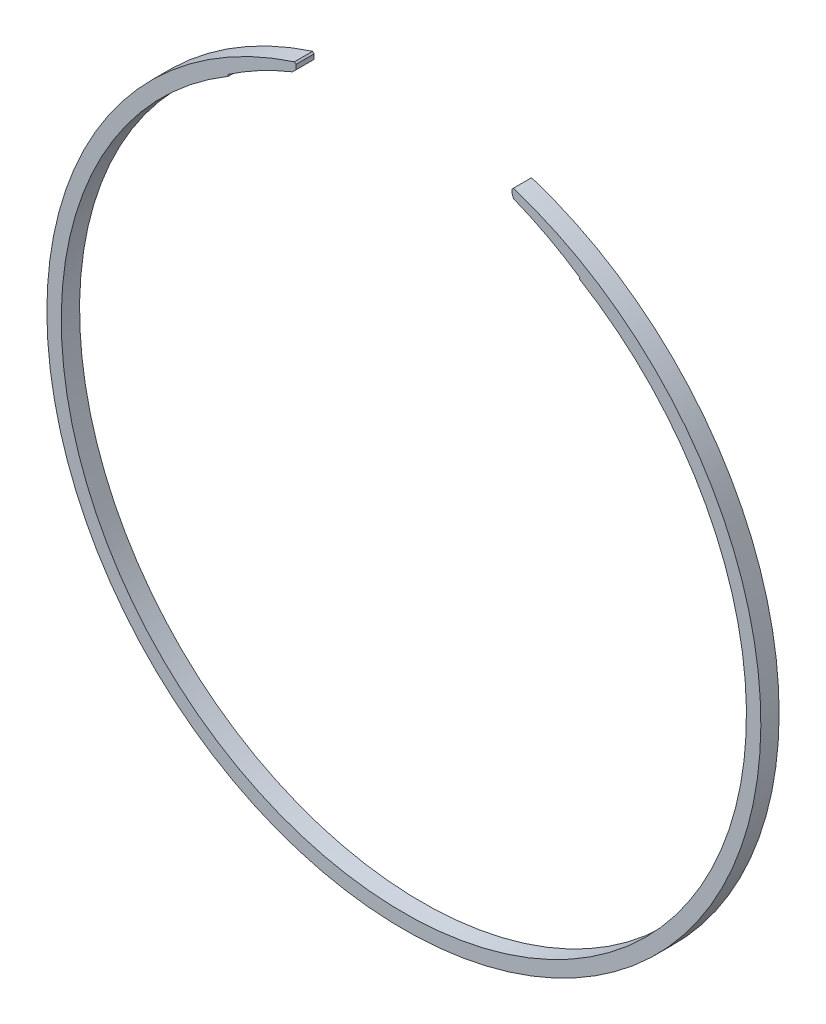
ISO-10303-21;
HEADER;
FILE_DESCRIPTION(('STEP AP214'),'2;1');
FILE_NAME('part.step','',(''),(''),'','','');
FILE_SCHEMA(('AUTOMOTIVE_DESIGN { 1 0 10303 214 1 1 1 1 }'));
ENDSEC;
DATA;
#1=APPLICATION_CONTEXT('core data for automotive mechanical design processes');
#2=APPLICATION_PROTOCOL_DEFINITION('international standard','automotive_design',2000,#1);
#3=PRODUCT_CONTEXT('',#1,'mechanical');
#4=PRODUCT('Part','Part','',(#3));
#5=PRODUCT_RELATED_PRODUCT_CATEGORY('part','',(#4));
#6=PRODUCT_DEFINITION_FORMATION('','',#4);
#7=PRODUCT_DEFINITION_CONTEXT('part definition',#1,'design');
#8=PRODUCT_DEFINITION('design','',#6,#7);
#9=PRODUCT_DEFINITION_SHAPE('','',#8);
#10=(LENGTH_UNIT() NAMED_UNIT(*) SI_UNIT(.MILLI.,.METRE.));
#11=(NAMED_UNIT(*) PLANE_ANGLE_UNIT() SI_UNIT($,.RADIAN.));
#12=(NAMED_UNIT(*) SI_UNIT($,.STERADIAN.) SOLID_ANGLE_UNIT());
#13=UNCERTAINTY_MEASURE_WITH_UNIT(LENGTH_MEASURE(1.E-05),#10,'distance_accuracy_value','');
#14=(GEOMETRIC_REPRESENTATION_CONTEXT(3) GLOBAL_UNCERTAINTY_ASSIGNED_CONTEXT((#13)) GLOBAL_UNIT_ASSIGNED_CONTEXT((#10,
#11,#12)) REPRESENTATION_CONTEXT('',''));
#15=CARTESIAN_POINT('',(0.,0.,0.));
#16=DIRECTION('',(0.,0.,1.));
#17=DIRECTION('',(1.,0.,0.));
#18=AXIS2_PLACEMENT_3D('',#15,#16,#17);
#19=CARTESIAN_POINT('',(0.,0.,6.35));
#20=DIRECTION('',(0.,0.,1.));
#21=DIRECTION('',(1.,0.,0.));
#22=AXIS2_PLACEMENT_3D('',#19,#20,#21);
#23=PLANE('',#22);
#24=DIRECTION('',(0.,1.,0.));
#25=VECTOR('',#24,1.);
#26=CARTESIAN_POINT('',(37.5,115.13848877654,6.35));
#27=LINE('',#26,#25);
#28=CARTESIAN_POINT('',(37.5,116.377362522914,6.35));
#29=VERTEX_POINT('',#28);
#30=CARTESIAN_POINT('',(37.5,117.493696955464,6.35));
#31=VERTEX_POINT('',#30);
#32=EDGE_CURVE('E215',#29,#31,#27,.T.);
#33=ORIENTED_EDGE('',*,*,#32,.F.);
#34=DIRECTION('',(-0.399536069175166,0.91671747524963,0.));
#35=VECTOR('',#34,1.);
#36=CARTESIAN_POINT('',(74.1384800976588,32.3120238378502,6.35));
#37=LINE('',#36,#35);
#38=CARTESIAN_POINT('',(38.1526630091302,114.879856710351,6.35));
#39=VERTEX_POINT('',#38);
#40=EDGE_CURVE('E191',#29,#39,#37,.F.);
#41=ORIENTED_EDGE('',*,*,#40,.T.);
#42=CARTESIAN_POINT('',(-6.74999999999999,2.51994012668422,6.35));
#43=DIRECTION('',(0.,0.,-1.));
#44=DIRECTION('',(1.,0.,0.));
#45=AXIS2_PLACEMENT_3D('',#42,#43,#44);
#46=CIRCLE('',#45,121.);
#47=CARTESIAN_POINT('',(61.195564516129,102.641867108662,6.35));
#48=VERTEX_POINT('',#47);
#49=EDGE_CURVE('E146',#39,#48,#46,.T.);
#50=ORIENTED_EDGE('',*,*,#49,.T.);
#51=DIRECTION('',(0.512096774193548,0.858927758231484,0.));
#52=VECTOR('',#51,1.);
#53=CARTESIAN_POINT('',(0.,0.,6.35));
#54=LINE('',#53,#52);
#55=CARTESIAN_POINT('',(60.9395161290323,102.212403229547,6.35));
#56=VERTEX_POINT('',#55);
#57=EDGE_CURVE('E133',#56,#48,#54,.T.);
#58=ORIENTED_EDGE('',*,*,#57,.F.);
#59=CARTESIAN_POINT('',(0.,0.,6.35));
#60=DIRECTION('',(0.,0.,1.));
#61=DIRECTION('',(1.,0.,0.));
#62=AXIS2_PLACEMENT_3D('',#59,#60,#61);
#63=CIRCLE('',#62,119.);
#64=CARTESIAN_POINT('',(-60.9395161290323,102.212403229547,6.35));
#65=VERTEX_POINT('',#64);
#66=EDGE_CURVE('E129',#65,#56,#63,.T.);
#67=ORIENTED_EDGE('',*,*,#66,.F.);
#68=DIRECTION('',(0.512096774193548,-0.858927758231484,0.));
#69=VECTOR('',#68,1.);
#70=CARTESIAN_POINT('',(-63.5,106.507042020704,6.35));
#71=LINE('',#70,#69);
#72=CARTESIAN_POINT('',(-61.195564516129,102.641867108662,6.35));
#73=VERTEX_POINT('',#72);
#74=EDGE_CURVE('E122',#73,#65,#71,.T.);
#75=ORIENTED_EDGE('',*,*,#74,.F.);
#76=CARTESIAN_POINT('',(6.75000000000001,2.51994012668422,6.35));
#77=DIRECTION('',(0.,0.,-1.));
#78=DIRECTION('',(-1.,0.,0.));
#79=AXIS2_PLACEMENT_3D('',#76,#77,#78);
#80=CIRCLE('',#79,121.);
#81=CARTESIAN_POINT('',(-38.664555730153,114.673933046387,6.35));
#82=VERTEX_POINT('',#81);
#83=EDGE_CURVE('E126',#73,#82,#80,.T.);
#84=ORIENTED_EDGE('',*,*,#83,.T.);
#85=DIRECTION('',(-0.707106781186552,-0.707106781186543,0.));
#86=VECTOR('',#85,1.);
#87=CARTESIAN_POINT('',(-76.66924438827,76.6692443882709,6.35));
#88=LINE('',#87,#86);
#89=CARTESIAN_POINT('',(-37.5,115.83848877654,6.35));
#90=VERTEX_POINT('',#89);
#91=EDGE_CURVE('E187',#82,#90,#88,.F.);
#92=ORIENTED_EDGE('',*,*,#91,.T.);
#93=DIRECTION('',(0.,-1.,0.));
#94=VECTOR('',#93,1.);
#95=CARTESIAN_POINT('',(-37.5,115.13848877654,6.35));
#96=LINE('',#95,#94);
#97=CARTESIAN_POINT('',(-37.5,117.493696955464,6.35));
#98=VERTEX_POINT('',#97);
#99=EDGE_CURVE('E211',#98,#90,#96,.T.);
#100=ORIENTED_EDGE('',*,*,#99,.F.);
#101=DIRECTION('',(0.707106781186548,-0.707106781186548,0.));
#102=VECTOR('',#101,1.);
#103=CARTESIAN_POINT('',(39.9968484777318,39.9968484777318,6.35));
#104=LINE('',#103,#102);
#105=CARTESIAN_POINT('',(-38.0304038886649,118.024100844129,6.35));
#106=VERTEX_POINT('',#105);
#107=EDGE_CURVE('E185',#98,#106,#104,.F.);
#108=ORIENTED_EDGE('',*,*,#107,.T.);
#109=CARTESIAN_POINT('',(0.,0.,6.35));
#110=DIRECTION('',(0.,0.,1.));
#111=DIRECTION('',(1.,0.,0.));
#112=AXIS2_PLACEMENT_3D('',#109,#110,#111);
#113=CIRCLE('',#112,124.);
#114=CARTESIAN_POINT('',(38.0304038886649,118.024100844129,6.35));
#115=VERTEX_POINT('',#114);
#116=EDGE_CURVE('E171',#106,#115,#113,.T.);
#117=ORIENTED_EDGE('',*,*,#116,.T.);
#118=DIRECTION('',(-0.707106781186557,-0.707106781186538,0.));
#119=VECTOR('',#118,1.);
#120=CARTESIAN_POINT('',(-39.9968484777323,39.9968484777334,6.35));
#121=LINE('',#120,#119);
#122=EDGE_CURVE('E189',#115,#31,#121,.T.);
#123=ORIENTED_EDGE('',*,*,#122,.T.);
#124=EDGE_LOOP('',(#33,#41,#50,#58,#67,#75,#84,#92,#100,#108,#117,#123));
#125=FACE_BOUND('',#124,.T.);
#126=ADVANCED_FACE('F32',(#125),#23,.T.);
#127=CARTESIAN_POINT('',(0.,0.,0.));
#128=DIRECTION('',(0.,0.,1.));
#129=DIRECTION('',(1.,0.,0.));
#130=AXIS2_PLACEMENT_3D('',#127,#128,#129);
#131=PLANE('',#130);
#132=CARTESIAN_POINT('',(-6.74999999999999,2.51994012668422,0.));
#133=DIRECTION('',(0.,0.,-1.));
#134=DIRECTION('',(1.,0.,0.));
#135=AXIS2_PLACEMENT_3D('',#132,#133,#134);
#136=CIRCLE('',#135,121.);
#137=CARTESIAN_POINT('',(38.1526630091302,114.879856710351,0.));
#138=VERTEX_POINT('',#137);
#139=CARTESIAN_POINT('',(61.195564516129,102.641867108662,0.));
#140=VERTEX_POINT('',#139);
#141=EDGE_CURVE('E155',#138,#140,#136,.T.);
#142=ORIENTED_EDGE('',*,*,#141,.F.);
#143=DIRECTION('',(0.399536069175166,-0.91671747524963,0.));
#144=VECTOR('',#143,1.);
#145=CARTESIAN_POINT('',(37.5,116.377362522914,0.));
#146=LINE('',#145,#144);
#147=CARTESIAN_POINT('',(37.5,116.377362522914,0.));
#148=VERTEX_POINT('',#147);
#149=EDGE_CURVE('E200',#138,#148,#146,.F.);
#150=ORIENTED_EDGE('',*,*,#149,.T.);
#151=DIRECTION('',(0.,1.,0.));
#152=VECTOR('',#151,1.);
#153=CARTESIAN_POINT('',(37.5,115.13848877654,0.));
#154=LINE('',#153,#152);
#155=CARTESIAN_POINT('',(37.5,117.493696955464,0.));
#156=VERTEX_POINT('',#155);
#157=EDGE_CURVE('E147',#148,#156,#154,.T.);
#158=ORIENTED_EDGE('',*,*,#157,.T.);
#159=DIRECTION('',(0.707106781186557,0.707106781186538,0.));
#160=VECTOR('',#159,1.);
#161=CARTESIAN_POINT('',(38.0304038886649,118.024100844129,0.));
#162=LINE('',#161,#160);
#163=CARTESIAN_POINT('',(38.0304038886649,118.024100844129,0.));
#164=VERTEX_POINT('',#163);
#165=EDGE_CURVE('E198',#156,#164,#162,.T.);
#166=ORIENTED_EDGE('',*,*,#165,.T.);
#167=CARTESIAN_POINT('',(0.,0.,0.));
#168=DIRECTION('',(0.,0.,1.));
#169=DIRECTION('',(1.,0.,0.));
#170=AXIS2_PLACEMENT_3D('',#167,#168,#169);
#171=CIRCLE('',#170,124.);
#172=CARTESIAN_POINT('',(-38.0304038886649,118.024100844129,0.));
#173=VERTEX_POINT('',#172);
#174=EDGE_CURVE('E168',#173,#164,#171,.T.);
#175=ORIENTED_EDGE('',*,*,#174,.F.);
#176=DIRECTION('',(-0.707106781186548,0.707106781186548,0.));
#177=VECTOR('',#176,1.);
#178=CARTESIAN_POINT('',(-38.0304038886649,118.024100844129,0.));
#179=LINE('',#178,#177);
#180=CARTESIAN_POINT('',(-37.5,117.493696955464,0.));
#181=VERTEX_POINT('',#180);
#182=EDGE_CURVE('E195',#173,#181,#179,.F.);
#183=ORIENTED_EDGE('',*,*,#182,.T.);
#184=DIRECTION('',(0.,-1.,0.));
#185=VECTOR('',#184,1.);
#186=CARTESIAN_POINT('',(-37.5,115.13848877654,0.));
#187=LINE('',#186,#185);
#188=CARTESIAN_POINT('',(-37.5,115.83848877654,0.));
#189=VERTEX_POINT('',#188);
#190=EDGE_CURVE('E152',#181,#189,#187,.T.);
#191=ORIENTED_EDGE('',*,*,#190,.T.);
#192=DIRECTION('',(0.707106781186552,0.707106781186543,0.));
#193=VECTOR('',#192,1.);
#194=CARTESIAN_POINT('',(-38.664555730153,114.673933046387,0.));
#195=LINE('',#194,#193);
#196=CARTESIAN_POINT('',(-38.664555730153,114.673933046387,0.));
#197=VERTEX_POINT('',#196);
#198=EDGE_CURVE('E47',#189,#197,#195,.F.);
#199=ORIENTED_EDGE('',*,*,#198,.T.);
#200=CARTESIAN_POINT('',(6.75000000000001,2.51994012668422,0.));
#201=DIRECTION('',(0.,0.,-1.));
#202=DIRECTION('',(-1.,0.,0.));
#203=AXIS2_PLACEMENT_3D('',#200,#201,#202);
#204=CIRCLE('',#203,121.);
#205=CARTESIAN_POINT('',(-61.195564516129,102.641867108662,0.));
#206=VERTEX_POINT('',#205);
#207=EDGE_CURVE('E149',#206,#197,#204,.T.);
#208=ORIENTED_EDGE('',*,*,#207,.F.);
#209=DIRECTION('',(0.512096774193548,-0.858927758231484,0.));
#210=VECTOR('',#209,1.);
#211=CARTESIAN_POINT('',(-63.5,106.507042020704,0.));
#212=LINE('',#211,#210);
#213=CARTESIAN_POINT('',(-60.9395161290323,102.212403229547,0.));
#214=VERTEX_POINT('',#213);
#215=EDGE_CURVE('E138',#206,#214,#212,.T.);
#216=ORIENTED_EDGE('',*,*,#215,.T.);
#217=CARTESIAN_POINT('',(0.,0.,0.));
#218=DIRECTION('',(0.,0.,1.));
#219=DIRECTION('',(1.,0.,0.));
#220=AXIS2_PLACEMENT_3D('',#217,#218,#219);
#221=CIRCLE('',#220,119.);
#222=CARTESIAN_POINT('',(60.9395161290323,102.212403229547,0.));
#223=VERTEX_POINT('',#222);
#224=EDGE_CURVE('E163',#214,#223,#221,.T.);
#225=ORIENTED_EDGE('',*,*,#224,.T.);
#226=DIRECTION('',(0.512096774193548,0.858927758231484,0.));
#227=VECTOR('',#226,1.);
#228=CARTESIAN_POINT('',(0.,0.,0.));
#229=LINE('',#228,#227);
#230=EDGE_CURVE('E161',#223,#140,#229,.T.);
#231=ORIENTED_EDGE('',*,*,#230,.T.);
#232=EDGE_LOOP('',(#142,#150,#158,#166,#175,#183,#191,#199,#208,#216,#225,#231));
#233=FACE_BOUND('',#232,.T.);
#234=ADVANCED_FACE('F223',(#233),#131,.F.);
#235=CARTESIAN_POINT('',(0.,0.,6.35));
#236=DIRECTION('',(0.,0.,-1.));
#237=DIRECTION('',(-1.,0.,0.));
#238=AXIS2_PLACEMENT_3D('',#235,#236,#237);
#239=CYLINDRICAL_SURFACE('',#238,124.);
#240=ORIENTED_EDGE('',*,*,#174,.T.);
#241=DIRECTION('',(0.,0.,-1.));
#242=VECTOR('',#241,1.);
#243=CARTESIAN_POINT('',(38.0304038886649,118.024100844129,6.35));
#244=LINE('',#243,#242);
#245=EDGE_CURVE('E205',#164,#115,#244,.F.);
#246=ORIENTED_EDGE('',*,*,#245,.T.);
#247=ORIENTED_EDGE('',*,*,#116,.F.);
#248=DIRECTION('',(0.,0.,-1.));
#249=VECTOR('',#248,1.);
#250=CARTESIAN_POINT('',(-38.0304038886649,118.024100844129,6.35));
#251=LINE('',#250,#249);
#252=EDGE_CURVE('E202',#106,#173,#251,.T.);
#253=ORIENTED_EDGE('',*,*,#252,.T.);
#254=EDGE_LOOP('',(#240,#246,#247,#253));
#255=FACE_BOUND('',#254,.T.);
#256=ADVANCED_FACE('F220',(#255),#239,.T.);
#257=CARTESIAN_POINT('',(0.,0.,6.35));
#258=DIRECTION('',(0.,0.,-1.));
#259=DIRECTION('',(-1.,0.,0.));
#260=AXIS2_PLACEMENT_3D('',#257,#258,#259);
#261=CYLINDRICAL_SURFACE('',#260,119.);
#262=DIRECTION('',(0.,0.,-1.));
#263=VECTOR('',#262,1.);
#264=CARTESIAN_POINT('',(60.9395161290323,102.212403229547,6.35));
#265=LINE('',#264,#263);
#266=EDGE_CURVE('E178',#223,#56,#265,.F.);
#267=ORIENTED_EDGE('',*,*,#266,.F.);
#268=ORIENTED_EDGE('',*,*,#224,.F.);
#269=DIRECTION('',(0.,0.,-1.));
#270=VECTOR('',#269,1.);
#271=CARTESIAN_POINT('',(-60.9395161290323,102.212403229547,6.35));
#272=LINE('',#271,#270);
#273=EDGE_CURVE('E174',#65,#214,#272,.T.);
#274=ORIENTED_EDGE('',*,*,#273,.F.);
#275=ORIENTED_EDGE('',*,*,#66,.T.);
#276=EDGE_LOOP('',(#267,#268,#274,#275));
#277=FACE_BOUND('',#276,.T.);
#278=ADVANCED_FACE('F246',(#277),#261,.F.);
#279=CARTESIAN_POINT('',(-63.5,106.507042020704,0.));
#280=DIRECTION('',(-0.858927758231484,-0.512096774193548,0.));
#281=DIRECTION('',(0.512096774193548,-0.858927758231484,0.));
#282=AXIS2_PLACEMENT_3D('',#279,#280,#281);
#283=PLANE('',#282);
#284=ORIENTED_EDGE('',*,*,#215,.F.);
#285=DIRECTION('',(0.,0.,1.));
#286=VECTOR('',#285,1.);
#287=CARTESIAN_POINT('',(-61.195564516129,102.641867108662,0.));
#288=LINE('',#287,#286);
#289=EDGE_CURVE('E134',#206,#73,#288,.T.);
#290=ORIENTED_EDGE('',*,*,#289,.T.);
#291=ORIENTED_EDGE('',*,*,#74,.T.);
#292=ORIENTED_EDGE('',*,*,#273,.T.);
#293=EDGE_LOOP('',(#284,#290,#291,#292));
#294=FACE_BOUND('',#293,.T.);
#295=ADVANCED_FACE('F137',(#294),#283,.F.);
#296=CARTESIAN_POINT('',(0.,0.,0.));
#297=DIRECTION('',(0.858927758231484,-0.512096774193548,0.));
#298=DIRECTION('',(0.512096774193548,0.858927758231484,0.));
#299=AXIS2_PLACEMENT_3D('',#296,#297,#298);
#300=PLANE('',#299);
#301=ORIENTED_EDGE('',*,*,#57,.T.);
#302=DIRECTION('',(0.,0.,1.));
#303=VECTOR('',#302,1.);
#304=CARTESIAN_POINT('',(61.195564516129,102.641867108662,0.));
#305=LINE('',#304,#303);
#306=EDGE_CURVE('E140',#140,#48,#305,.T.);
#307=ORIENTED_EDGE('',*,*,#306,.F.);
#308=ORIENTED_EDGE('',*,*,#230,.F.);
#309=ORIENTED_EDGE('',*,*,#266,.T.);
#310=EDGE_LOOP('',(#301,#307,#308,#309));
#311=FACE_BOUND('',#310,.T.);
#312=ADVANCED_FACE('F242',(#311),#300,.F.);
#313=CARTESIAN_POINT('',(6.75000000000001,2.51994012668422,0.));
#314=DIRECTION('',(0.,0.,1.));
#315=DIRECTION('',(1.,0.,0.));
#316=AXIS2_PLACEMENT_3D('',#313,#314,#315);
#317=CYLINDRICAL_SURFACE('',#316,121.);
#318=ORIENTED_EDGE('',*,*,#207,.T.);
#319=DIRECTION('',(0.,0.,1.));
#320=VECTOR('',#319,1.);
#321=CARTESIAN_POINT('',(-38.664555730153,114.673933046387,0.));
#322=LINE('',#321,#320);
#323=EDGE_CURVE('E145',#197,#82,#322,.T.);
#324=ORIENTED_EDGE('',*,*,#323,.T.);
#325=ORIENTED_EDGE('',*,*,#83,.F.);
#326=ORIENTED_EDGE('',*,*,#289,.F.);
#327=EDGE_LOOP('',(#318,#324,#325,#326));
#328=FACE_BOUND('',#327,.T.);
#329=ADVANCED_FACE('F143',(#328),#317,.F.);
#330=CARTESIAN_POINT('',(-6.74999999999999,2.51994012668422,0.));
#331=DIRECTION('',(0.,0.,1.));
#332=DIRECTION('',(1.,0.,0.));
#333=AXIS2_PLACEMENT_3D('',#330,#331,#332);
#334=CYLINDRICAL_SURFACE('',#333,121.);
#335=ORIENTED_EDGE('',*,*,#49,.F.);
#336=DIRECTION('',(0.,0.,1.));
#337=VECTOR('',#336,1.);
#338=CARTESIAN_POINT('',(38.1526630091302,114.879856710351,0.));
#339=LINE('',#338,#337);
#340=EDGE_CURVE('E193',#39,#138,#339,.F.);
#341=ORIENTED_EDGE('',*,*,#340,.T.);
#342=ORIENTED_EDGE('',*,*,#141,.T.);
#343=ORIENTED_EDGE('',*,*,#306,.T.);
#344=EDGE_LOOP('',(#335,#341,#342,#343));
#345=FACE_BOUND('',#344,.T.);
#346=ADVANCED_FACE('F238',(#345),#334,.F.);
#347=CARTESIAN_POINT('',(37.5,115.13848877654,0.));
#348=DIRECTION('',(1.,0.,0.));
#349=DIRECTION('',(0.,0.,-1.));
#350=AXIS2_PLACEMENT_3D('',#347,#348,#349);
#351=PLANE('',#350);
#352=ORIENTED_EDGE('',*,*,#157,.F.);
#353=DIRECTION('',(0.,0.,1.));
#354=VECTOR('',#353,1.);
#355=CARTESIAN_POINT('',(37.5,116.377362522914,6.35));
#356=LINE('',#355,#354);
#357=EDGE_CURVE('E182',#148,#29,#356,.T.);
#358=ORIENTED_EDGE('',*,*,#357,.T.);
#359=ORIENTED_EDGE('',*,*,#32,.T.);
#360=DIRECTION('',(0.,0.,-1.));
#361=VECTOR('',#360,1.);
#362=CARTESIAN_POINT('',(37.5,117.493696955464,0.));
#363=LINE('',#362,#361);
#364=EDGE_CURVE('E180',#31,#156,#363,.T.);
#365=ORIENTED_EDGE('',*,*,#364,.T.);
#366=EDGE_LOOP('',(#352,#358,#359,#365));
#367=FACE_BOUND('',#366,.T.);
#368=ADVANCED_FACE('F231',(#367),#351,.F.);
#369=CARTESIAN_POINT('',(-37.5,115.13848877654,0.));
#370=DIRECTION('',(-1.,0.,0.));
#371=DIRECTION('',(0.,0.,1.));
#372=AXIS2_PLACEMENT_3D('',#369,#370,#371);
#373=PLANE('',#372);
#374=ORIENTED_EDGE('',*,*,#99,.T.);
#375=DIRECTION('',(0.,0.,-1.));
#376=VECTOR('',#375,1.);
#377=CARTESIAN_POINT('',(-37.5,115.83848877654,0.));
#378=LINE('',#377,#376);
#379=EDGE_CURVE('E11',#90,#189,#378,.T.);
#380=ORIENTED_EDGE('',*,*,#379,.T.);
#381=ORIENTED_EDGE('',*,*,#190,.F.);
#382=DIRECTION('',(0.,0.,1.));
#383=VECTOR('',#382,1.);
#384=CARTESIAN_POINT('',(-37.5,117.493696955464,0.));
#385=LINE('',#384,#383);
#386=EDGE_CURVE('E40',#181,#98,#385,.T.);
#387=ORIENTED_EDGE('',*,*,#386,.T.);
#388=EDGE_LOOP('',(#374,#380,#381,#387));
#389=FACE_BOUND('',#388,.T.);
#390=ADVANCED_FACE('F210',(#389),#373,.F.);
#391=CARTESIAN_POINT('',(37.5,116.377362522914,0.));
#392=DIRECTION('',(0.91671747524963,0.399536069175166,0.));
#393=DIRECTION('',(0.,0.,1.));
#394=AXIS2_PLACEMENT_3D('',#391,#392,#393);
#395=PLANE('',#394);
#396=ORIENTED_EDGE('',*,*,#149,.F.);
#397=ORIENTED_EDGE('',*,*,#340,.F.);
#398=ORIENTED_EDGE('',*,*,#40,.F.);
#399=ORIENTED_EDGE('',*,*,#357,.F.);
#400=EDGE_LOOP('',(#396,#397,#398,#399));
#401=FACE_BOUND('',#400,.T.);
#402=ADVANCED_FACE('F248',(#401),#395,.F.);
#403=CARTESIAN_POINT('',(38.0304038886649,118.024100844129,6.35));
#404=DIRECTION('',(-0.707106781186538,0.707106781186557,0.));
#405=DIRECTION('',(0.,0.,-1.));
#406=AXIS2_PLACEMENT_3D('',#403,#404,#405);
#407=PLANE('',#406);
#408=ORIENTED_EDGE('',*,*,#165,.F.);
#409=ORIENTED_EDGE('',*,*,#364,.F.);
#410=ORIENTED_EDGE('',*,*,#122,.F.);
#411=ORIENTED_EDGE('',*,*,#245,.F.);
#412=EDGE_LOOP('',(#408,#409,#410,#411));
#413=FACE_BOUND('',#412,.T.);
#414=ADVANCED_FACE('F228',(#413),#407,.T.);
#415=CARTESIAN_POINT('',(-38.664555730153,114.673933046387,0.));
#416=DIRECTION('',(-0.707106781186543,0.707106781186552,0.));
#417=DIRECTION('',(0.,0.,1.));
#418=AXIS2_PLACEMENT_3D('',#415,#416,#417);
#419=PLANE('',#418);
#420=ORIENTED_EDGE('',*,*,#198,.F.);
#421=ORIENTED_EDGE('',*,*,#379,.F.);
#422=ORIENTED_EDGE('',*,*,#91,.F.);
#423=ORIENTED_EDGE('',*,*,#323,.F.);
#424=EDGE_LOOP('',(#420,#421,#422,#423));
#425=FACE_BOUND('',#424,.T.);
#426=ADVANCED_FACE('F255',(#425),#419,.F.);
#427=CARTESIAN_POINT('',(-38.0304038886649,118.024100844129,6.35));
#428=DIRECTION('',(-0.707106781186547,-0.707106781186547,0.));
#429=DIRECTION('',(0.,0.,-1.));
#430=AXIS2_PLACEMENT_3D('',#427,#428,#429);
#431=PLANE('',#430);
#432=ORIENTED_EDGE('',*,*,#107,.F.);
#433=ORIENTED_EDGE('',*,*,#386,.F.);
#434=ORIENTED_EDGE('',*,*,#182,.F.);
#435=ORIENTED_EDGE('',*,*,#252,.F.);
#436=EDGE_LOOP('',(#432,#433,#434,#435));
#437=FACE_BOUND('',#436,.T.);
#438=ADVANCED_FACE('F34',(#437),#431,.F.);
#439=CLOSED_SHELL('',(#126,#234,#256,#278,#295,#312,#329,#346,#368,#390,#402,#414,#426,#438));
#440=MANIFOLD_SOLID_BREP('B2',#439);
#441=ADVANCED_BREP_SHAPE_REPRESENTATION('',(#18,#440),#14);
#442=SHAPE_DEFINITION_REPRESENTATION(#9,#441);
ENDSEC;
END-ISO-10303-21;
